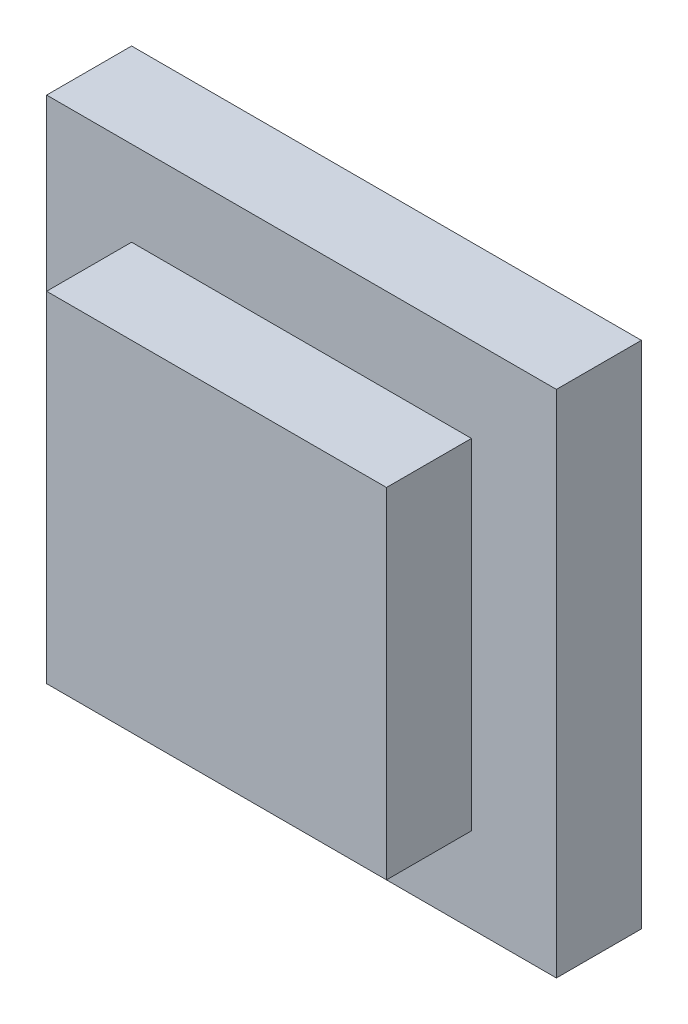
ISO-10303-21;
HEADER;
FILE_DESCRIPTION(('STEP AP214'),'2;1');
FILE_NAME('part.step','',(''),(''),'','','');
FILE_SCHEMA(('AUTOMOTIVE_DESIGN { 1 0 10303 214 1 1 1 1 }'));
ENDSEC;
DATA;
#1=APPLICATION_CONTEXT('core data for automotive mechanical design processes');
#2=APPLICATION_PROTOCOL_DEFINITION('international standard','automotive_design',2000,#1);
#3=PRODUCT_CONTEXT('',#1,'mechanical');
#4=PRODUCT('Part','Part','',(#3));
#5=PRODUCT_RELATED_PRODUCT_CATEGORY('part','',(#4));
#6=PRODUCT_DEFINITION_FORMATION('','',#4);
#7=PRODUCT_DEFINITION_CONTEXT('part definition',#1,'design');
#8=PRODUCT_DEFINITION('design','',#6,#7);
#9=PRODUCT_DEFINITION_SHAPE('','',#8);
#10=(LENGTH_UNIT() NAMED_UNIT(*) SI_UNIT(.MILLI.,.METRE.));
#11=(NAMED_UNIT(*) PLANE_ANGLE_UNIT() SI_UNIT($,.RADIAN.));
#12=(NAMED_UNIT(*) SI_UNIT($,.STERADIAN.) SOLID_ANGLE_UNIT());
#13=UNCERTAINTY_MEASURE_WITH_UNIT(LENGTH_MEASURE(1.E-05),#10,'distance_accuracy_value','');
#14=(GEOMETRIC_REPRESENTATION_CONTEXT(3) GLOBAL_UNCERTAINTY_ASSIGNED_CONTEXT((#13)) GLOBAL_UNIT_ASSIGNED_CONTEXT((#10,
#11,#12)) REPRESENTATION_CONTEXT('',''));
#15=CARTESIAN_POINT('',(0.,0.,0.));
#16=DIRECTION('',(0.,0.,1.));
#17=DIRECTION('',(1.,0.,0.));
#18=AXIS2_PLACEMENT_3D('',#15,#16,#17);
#19=CARTESIAN_POINT('',(0.,-4.,4.));
#20=DIRECTION('',(0.,1.,0.));
#21=DIRECTION('',(0.,0.,1.));
#22=AXIS2_PLACEMENT_3D('',#19,#20,#21);
#23=PLANE('',#22);
#24=DIRECTION('',(1.,0.,0.));
#25=VECTOR('',#24,1.);
#26=CARTESIAN_POINT('',(-4.,-4.,2.));
#27=LINE('',#26,#25);
#28=CARTESIAN_POINT('',(-4.,-4.,2.));
#29=VERTEX_POINT('',#28);
#30=CARTESIAN_POINT('',(4.,-4.,2.));
#31=VERTEX_POINT('',#30);
#32=EDGE_CURVE('E60',#29,#31,#27,.T.);
#33=ORIENTED_EDGE('',*,*,#32,.T.);
#34=DIRECTION('',(0.,0.,-1.));
#35=VECTOR('',#34,1.);
#36=CARTESIAN_POINT('',(4.,-4.,4.));
#37=LINE('',#36,#35);
#38=CARTESIAN_POINT('',(4.,-4.,4.));
#39=VERTEX_POINT('',#38);
#40=EDGE_CURVE('E11',#39,#31,#37,.T.);
#41=ORIENTED_EDGE('',*,*,#40,.F.);
#42=DIRECTION('',(1.,0.,0.));
#43=VECTOR('',#42,1.);
#44=CARTESIAN_POINT('',(0.,-4.,4.));
#45=LINE('',#44,#43);
#46=CARTESIAN_POINT('',(-4.,-4.,4.));
#47=VERTEX_POINT('',#46);
#48=EDGE_CURVE('E144',#47,#39,#45,.T.);
#49=ORIENTED_EDGE('',*,*,#48,.F.);
#50=DIRECTION('',(0.,0.,-1.));
#51=VECTOR('',#50,1.);
#52=CARTESIAN_POINT('',(-4.,-4.,4.));
#53=LINE('',#52,#51);
#54=EDGE_CURVE('E67',#47,#29,#53,.T.);
#55=ORIENTED_EDGE('',*,*,#54,.T.);
#56=EDGE_LOOP('',(#33,#41,#49,#55));
#57=FACE_BOUND('',#56,.T.);
#58=ADVANCED_FACE('F45',(#57),#23,.F.);
#59=CARTESIAN_POINT('',(4.,0.,4.));
#60=DIRECTION('',(-1.,0.,0.));
#61=DIRECTION('',(0.,0.,1.));
#62=AXIS2_PLACEMENT_3D('',#59,#60,#61);
#63=PLANE('',#62);
#64=DIRECTION('',(0.,1.,0.));
#65=VECTOR('',#64,1.);
#66=CARTESIAN_POINT('',(4.,-4.,2.));
#67=LINE('',#66,#65);
#68=CARTESIAN_POINT('',(4.,4.,2.));
#69=VERTEX_POINT('',#68);
#70=EDGE_CURVE('E112',#31,#69,#67,.T.);
#71=ORIENTED_EDGE('',*,*,#70,.T.);
#72=DIRECTION('',(0.,0.,-1.));
#73=VECTOR('',#72,1.);
#74=CARTESIAN_POINT('',(4.,4.,4.));
#75=LINE('',#74,#73);
#76=CARTESIAN_POINT('',(4.,4.,4.));
#77=VERTEX_POINT('',#76);
#78=EDGE_CURVE('E53',#77,#69,#75,.T.);
#79=ORIENTED_EDGE('',*,*,#78,.F.);
#80=DIRECTION('',(0.,1.,0.));
#81=VECTOR('',#80,1.);
#82=CARTESIAN_POINT('',(4.,0.,4.));
#83=LINE('',#82,#81);
#84=EDGE_CURVE('E141',#39,#77,#83,.T.);
#85=ORIENTED_EDGE('',*,*,#84,.F.);
#86=ORIENTED_EDGE('',*,*,#40,.T.);
#87=EDGE_LOOP('',(#71,#79,#85,#86));
#88=FACE_BOUND('',#87,.T.);
#89=ADVANCED_FACE('F121',(#88),#63,.F.);
#90=CARTESIAN_POINT('',(0.,4.,4.));
#91=DIRECTION('',(0.,1.,0.));
#92=DIRECTION('',(0.,0.,1.));
#93=AXIS2_PLACEMENT_3D('',#90,#91,#92);
#94=PLANE('',#93);
#95=ORIENTED_EDGE('',*,*,#78,.T.);
#96=DIRECTION('',(-1.,0.,0.));
#97=VECTOR('',#96,1.);
#98=CARTESIAN_POINT('',(-4.,4.,2.));
#99=LINE('',#98,#97);
#100=CARTESIAN_POINT('',(-4.,4.,2.));
#101=VERTEX_POINT('',#100);
#102=EDGE_CURVE('E109',#69,#101,#99,.T.);
#103=ORIENTED_EDGE('',*,*,#102,.T.);
#104=DIRECTION('',(0.,0.,-1.));
#105=VECTOR('',#104,1.);
#106=CARTESIAN_POINT('',(-4.,4.,4.));
#107=LINE('',#106,#105);
#108=CARTESIAN_POINT('',(-4.,4.,4.));
#109=VERTEX_POINT('',#108);
#110=EDGE_CURVE('E130',#109,#101,#107,.T.);
#111=ORIENTED_EDGE('',*,*,#110,.F.);
#112=DIRECTION('',(1.,0.,0.));
#113=VECTOR('',#112,1.);
#114=CARTESIAN_POINT('',(0.,4.,4.));
#115=LINE('',#114,#113);
#116=EDGE_CURVE('E128',#109,#77,#115,.T.);
#117=ORIENTED_EDGE('',*,*,#116,.T.);
#118=EDGE_LOOP('',(#95,#103,#111,#117));
#119=FACE_BOUND('',#118,.T.);
#120=ADVANCED_FACE('F126',(#119),#94,.T.);
#121=CARTESIAN_POINT('',(-4.,0.,4.));
#122=DIRECTION('',(-1.,0.,0.));
#123=DIRECTION('',(0.,0.,1.));
#124=AXIS2_PLACEMENT_3D('',#121,#122,#123);
#125=PLANE('',#124);
#126=ORIENTED_EDGE('',*,*,#110,.T.);
#127=DIRECTION('',(0.,-1.,0.));
#128=VECTOR('',#127,1.);
#129=CARTESIAN_POINT('',(-4.,-4.,2.));
#130=LINE('',#129,#128);
#131=EDGE_CURVE('E113',#101,#29,#130,.T.);
#132=ORIENTED_EDGE('',*,*,#131,.T.);
#133=ORIENTED_EDGE('',*,*,#54,.F.);
#134=DIRECTION('',(0.,1.,0.));
#135=VECTOR('',#134,1.);
#136=CARTESIAN_POINT('',(-4.,0.,4.));
#137=LINE('',#136,#135);
#138=EDGE_CURVE('E136',#47,#109,#137,.T.);
#139=ORIENTED_EDGE('',*,*,#138,.T.);
#140=EDGE_LOOP('',(#126,#132,#133,#139));
#141=FACE_BOUND('',#140,.T.);
#142=ADVANCED_FACE('F193',(#141),#125,.T.);
#143=CARTESIAN_POINT('',(0.,0.,4.));
#144=DIRECTION('',(0.,0.,1.));
#145=DIRECTION('',(1.,0.,0.));
#146=AXIS2_PLACEMENT_3D('',#143,#144,#145);
#147=PLANE('',#146);
#148=ORIENTED_EDGE('',*,*,#48,.T.);
#149=ORIENTED_EDGE('',*,*,#84,.T.);
#150=ORIENTED_EDGE('',*,*,#116,.F.);
#151=ORIENTED_EDGE('',*,*,#138,.F.);
#152=EDGE_LOOP('',(#148,#149,#150,#151));
#153=FACE_BOUND('',#152,.T.);
#154=ADVANCED_FACE('F197',(#153),#147,.T.);
#155=CARTESIAN_POINT('',(0.,0.,2.));
#156=DIRECTION('',(0.,0.,-1.));
#157=DIRECTION('',(-1.,0.,0.));
#158=AXIS2_PLACEMENT_3D('',#155,#156,#157);
#159=PLANE('',#158);
#160=DIRECTION('',(0.,1.,0.));
#161=VECTOR('',#160,1.);
#162=CARTESIAN_POINT('',(6.,-6.,2.));
#163=LINE('',#162,#161);
#164=CARTESIAN_POINT('',(6.,-6.,2.));
#165=VERTEX_POINT('',#164);
#166=CARTESIAN_POINT('',(6.,6.,2.));
#167=VERTEX_POINT('',#166);
#168=EDGE_CURVE('E168',#165,#167,#163,.T.);
#169=ORIENTED_EDGE('',*,*,#168,.T.);
#170=DIRECTION('',(-1.,0.,0.));
#171=VECTOR('',#170,1.);
#172=CARTESIAN_POINT('',(-6.,6.,2.));
#173=LINE('',#172,#171);
#174=CARTESIAN_POINT('',(-6.,6.,2.));
#175=VERTEX_POINT('',#174);
#176=EDGE_CURVE('E184',#167,#175,#173,.T.);
#177=ORIENTED_EDGE('',*,*,#176,.T.);
#178=DIRECTION('',(0.,-1.,0.));
#179=VECTOR('',#178,1.);
#180=CARTESIAN_POINT('',(-6.,-6.,2.));
#181=LINE('',#180,#179);
#182=CARTESIAN_POINT('',(-6.,-6.,2.));
#183=VERTEX_POINT('',#182);
#184=EDGE_CURVE('E181',#175,#183,#181,.T.);
#185=ORIENTED_EDGE('',*,*,#184,.T.);
#186=DIRECTION('',(1.,0.,0.));
#187=VECTOR('',#186,1.);
#188=CARTESIAN_POINT('',(-6.,-6.,2.));
#189=LINE('',#188,#187);
#190=EDGE_CURVE('E164',#183,#165,#189,.T.);
#191=ORIENTED_EDGE('',*,*,#190,.T.);
#192=EDGE_LOOP('',(#169,#177,#185,#191));
#193=FACE_BOUND('',#192,.T.);
#194=ORIENTED_EDGE('',*,*,#70,.F.);
#195=ORIENTED_EDGE('',*,*,#32,.F.);
#196=ORIENTED_EDGE('',*,*,#131,.F.);
#197=ORIENTED_EDGE('',*,*,#102,.F.);
#198=EDGE_LOOP('',(#194,#195,#196,#197));
#199=FACE_BOUND('',#198,.T.);
#200=ADVANCED_FACE('F111',(#193,#199),#159,.F.);
#201=CARTESIAN_POINT('',(6.,-6.,2.));
#202=DIRECTION('',(-1.,0.,0.));
#203=DIRECTION('',(0.,0.,1.));
#204=AXIS2_PLACEMENT_3D('',#201,#202,#203);
#205=PLANE('',#204);
#206=DIRECTION('',(0.,1.,0.));
#207=VECTOR('',#206,1.);
#208=CARTESIAN_POINT('',(6.,-6.,0.));
#209=LINE('',#208,#207);
#210=CARTESIAN_POINT('',(6.,-6.,0.));
#211=VERTEX_POINT('',#210);
#212=CARTESIAN_POINT('',(6.,6.,0.));
#213=VERTEX_POINT('',#212);
#214=EDGE_CURVE('E175',#211,#213,#209,.T.);
#215=ORIENTED_EDGE('',*,*,#214,.T.);
#216=DIRECTION('',(0.,0.,-1.));
#217=VECTOR('',#216,1.);
#218=CARTESIAN_POINT('',(6.,6.,2.));
#219=LINE('',#218,#217);
#220=EDGE_CURVE('E148',#167,#213,#219,.T.);
#221=ORIENTED_EDGE('',*,*,#220,.F.);
#222=ORIENTED_EDGE('',*,*,#168,.F.);
#223=DIRECTION('',(0.,0.,-1.));
#224=VECTOR('',#223,1.);
#225=CARTESIAN_POINT('',(6.,-6.,2.));
#226=LINE('',#225,#224);
#227=EDGE_CURVE('E160',#165,#211,#226,.T.);
#228=ORIENTED_EDGE('',*,*,#227,.T.);
#229=EDGE_LOOP('',(#215,#221,#222,#228));
#230=FACE_BOUND('',#229,.T.);
#231=ADVANCED_FACE('F204',(#230),#205,.F.);
#232=CARTESIAN_POINT('',(-6.,6.,2.));
#233=DIRECTION('',(0.,-1.,0.));
#234=DIRECTION('',(0.,0.,-1.));
#235=AXIS2_PLACEMENT_3D('',#232,#233,#234);
#236=PLANE('',#235);
#237=DIRECTION('',(-1.,0.,0.));
#238=VECTOR('',#237,1.);
#239=CARTESIAN_POINT('',(-6.,6.,0.));
#240=LINE('',#239,#238);
#241=CARTESIAN_POINT('',(-6.,6.,0.));
#242=VERTEX_POINT('',#241);
#243=EDGE_CURVE('E172',#213,#242,#240,.T.);
#244=ORIENTED_EDGE('',*,*,#243,.T.);
#245=DIRECTION('',(0.,0.,-1.));
#246=VECTOR('',#245,1.);
#247=CARTESIAN_POINT('',(-6.,6.,2.));
#248=LINE('',#247,#246);
#249=EDGE_CURVE('E152',#175,#242,#248,.T.);
#250=ORIENTED_EDGE('',*,*,#249,.F.);
#251=ORIENTED_EDGE('',*,*,#176,.F.);
#252=ORIENTED_EDGE('',*,*,#220,.T.);
#253=EDGE_LOOP('',(#244,#250,#251,#252));
#254=FACE_BOUND('',#253,.T.);
#255=ADVANCED_FACE('F241',(#254),#236,.F.);
#256=CARTESIAN_POINT('',(-6.,-6.,2.));
#257=DIRECTION('',(1.,0.,0.));
#258=DIRECTION('',(0.,0.,-1.));
#259=AXIS2_PLACEMENT_3D('',#256,#257,#258);
#260=PLANE('',#259);
#261=DIRECTION('',(0.,-1.,0.));
#262=VECTOR('',#261,1.);
#263=CARTESIAN_POINT('',(-6.,-6.,0.));
#264=LINE('',#263,#262);
#265=CARTESIAN_POINT('',(-6.,-6.,0.));
#266=VERTEX_POINT('',#265);
#267=EDGE_CURVE('E169',#242,#266,#264,.T.);
#268=ORIENTED_EDGE('',*,*,#267,.T.);
#269=DIRECTION('',(0.,0.,-1.));
#270=VECTOR('',#269,1.);
#271=CARTESIAN_POINT('',(-6.,-6.,2.));
#272=LINE('',#271,#270);
#273=EDGE_CURVE('E156',#183,#266,#272,.T.);
#274=ORIENTED_EDGE('',*,*,#273,.F.);
#275=ORIENTED_EDGE('',*,*,#184,.F.);
#276=ORIENTED_EDGE('',*,*,#249,.T.);
#277=EDGE_LOOP('',(#268,#274,#275,#276));
#278=FACE_BOUND('',#277,.T.);
#279=ADVANCED_FACE('F225',(#278),#260,.F.);
#280=CARTESIAN_POINT('',(-6.,-6.,2.));
#281=DIRECTION('',(0.,1.,0.));
#282=DIRECTION('',(0.,0.,1.));
#283=AXIS2_PLACEMENT_3D('',#280,#281,#282);
#284=PLANE('',#283);
#285=DIRECTION('',(1.,0.,0.));
#286=VECTOR('',#285,1.);
#287=CARTESIAN_POINT('',(-6.,-6.,0.));
#288=LINE('',#287,#286);
#289=EDGE_CURVE('E165',#266,#211,#288,.T.);
#290=ORIENTED_EDGE('',*,*,#289,.T.);
#291=ORIENTED_EDGE('',*,*,#227,.F.);
#292=ORIENTED_EDGE('',*,*,#190,.F.);
#293=ORIENTED_EDGE('',*,*,#273,.T.);
#294=EDGE_LOOP('',(#290,#291,#292,#293));
#295=FACE_BOUND('',#294,.T.);
#296=ADVANCED_FACE('F220',(#295),#284,.F.);
#297=CARTESIAN_POINT('',(0.,0.,0.));
#298=DIRECTION('',(0.,0.,1.));
#299=DIRECTION('',(1.,0.,0.));
#300=AXIS2_PLACEMENT_3D('',#297,#298,#299);
#301=PLANE('',#300);
#302=ORIENTED_EDGE('',*,*,#214,.F.);
#303=ORIENTED_EDGE('',*,*,#289,.F.);
#304=ORIENTED_EDGE('',*,*,#267,.F.);
#305=ORIENTED_EDGE('',*,*,#243,.F.);
#306=EDGE_LOOP('',(#302,#303,#304,#305));
#307=FACE_BOUND('',#306,.T.);
#308=ADVANCED_FACE('F218',(#307),#301,.F.);
#309=CLOSED_SHELL('',(#58,#89,#120,#142,#154,#200,#231,#255,#279,#296,#308));
#310=MANIFOLD_SOLID_BREP('B2',#309);
#311=ADVANCED_BREP_SHAPE_REPRESENTATION('',(#18,#310),#14);
#312=SHAPE_DEFINITION_REPRESENTATION(#9,#311);
ENDSEC;
END-ISO-10303-21;
